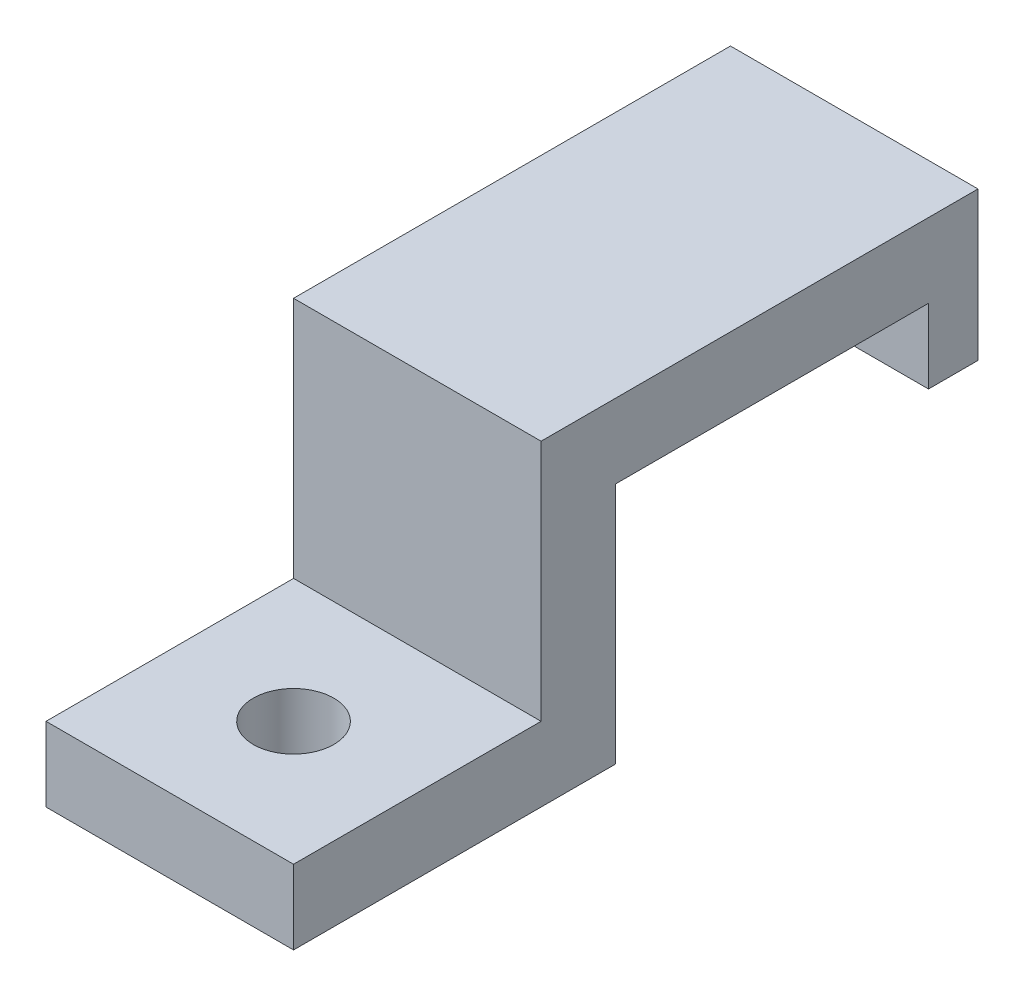
ISO-10303-21;
HEADER;
FILE_DESCRIPTION(('STEP AP214'),'2;1');
FILE_NAME('part.step','',(''),(''),'','','');
FILE_SCHEMA(('AUTOMOTIVE_DESIGN { 1 0 10303 214 1 1 1 1 }'));
ENDSEC;
DATA;
#1=APPLICATION_CONTEXT('core data for automotive mechanical design processes');
#2=APPLICATION_PROTOCOL_DEFINITION('international standard','automotive_design',2000,#1);
#3=PRODUCT_CONTEXT('',#1,'mechanical');
#4=PRODUCT('Part','Part','',(#3));
#5=PRODUCT_RELATED_PRODUCT_CATEGORY('part','',(#4));
#6=PRODUCT_DEFINITION_FORMATION('','',#4);
#7=PRODUCT_DEFINITION_CONTEXT('part definition',#1,'design');
#8=PRODUCT_DEFINITION('design','',#6,#7);
#9=PRODUCT_DEFINITION_SHAPE('','',#8);
#10=(LENGTH_UNIT() NAMED_UNIT(*) SI_UNIT(.MILLI.,.METRE.));
#11=(NAMED_UNIT(*) PLANE_ANGLE_UNIT() SI_UNIT($,.RADIAN.));
#12=(NAMED_UNIT(*) SI_UNIT($,.STERADIAN.) SOLID_ANGLE_UNIT());
#13=UNCERTAINTY_MEASURE_WITH_UNIT(LENGTH_MEASURE(1.E-05),#10,'distance_accuracy_value','');
#14=(GEOMETRIC_REPRESENTATION_CONTEXT(3) GLOBAL_UNCERTAINTY_ASSIGNED_CONTEXT((#13)) GLOBAL_UNIT_ASSIGNED_CONTEXT((#10,
#11,#12)) REPRESENTATION_CONTEXT('',''));
#15=CARTESIAN_POINT('',(0.,0.,0.));
#16=DIRECTION('',(0.,0.,1.));
#17=DIRECTION('',(1.,0.,0.));
#18=AXIS2_PLACEMENT_3D('',#15,#16,#17);
#19=CARTESIAN_POINT('',(10.,3.,0.));
#20=DIRECTION('',(0.,0.,-1.));
#21=DIRECTION('',(0.,1.,0.));
#22=AXIS2_PLACEMENT_3D('',#19,#20,#21);
#23=PLANE('',#22);
#24=DIRECTION('',(0.,-1.,0.));
#25=VECTOR('',#24,1.);
#26=CARTESIAN_POINT('',(0.,3.,0.));
#27=LINE('',#26,#25);
#28=CARTESIAN_POINT('',(0.,3.,0.));
#29=VERTEX_POINT('',#28);
#30=CARTESIAN_POINT('',(0.,0.,0.));
#31=VERTEX_POINT('',#30);
#32=EDGE_CURVE('E129',#29,#31,#27,.T.);
#33=ORIENTED_EDGE('',*,*,#32,.T.);
#34=DIRECTION('',(-1.,0.,0.));
#35=VECTOR('',#34,1.);
#36=CARTESIAN_POINT('',(10.,0.,0.));
#37=LINE('',#36,#35);
#38=CARTESIAN_POINT('',(10.,0.,0.));
#39=VERTEX_POINT('',#38);
#40=EDGE_CURVE('E11',#39,#31,#37,.T.);
#41=ORIENTED_EDGE('',*,*,#40,.F.);
#42=DIRECTION('',(0.,-1.,0.));
#43=VECTOR('',#42,1.);
#44=CARTESIAN_POINT('',(10.,3.,0.));
#45=LINE('',#44,#43);
#46=CARTESIAN_POINT('',(10.,3.,0.));
#47=VERTEX_POINT('',#46);
#48=EDGE_CURVE('E141',#47,#39,#45,.T.);
#49=ORIENTED_EDGE('',*,*,#48,.F.);
#50=DIRECTION('',(-1.,0.,0.));
#51=VECTOR('',#50,1.);
#52=CARTESIAN_POINT('',(10.,3.,0.));
#53=LINE('',#52,#51);
#54=EDGE_CURVE('E125',#47,#29,#53,.T.);
#55=ORIENTED_EDGE('',*,*,#54,.T.);
#56=EDGE_LOOP('',(#33,#41,#49,#55));
#57=FACE_BOUND('',#56,.T.);
#58=ADVANCED_FACE('F33',(#57),#23,.F.);
#59=CARTESIAN_POINT('',(10.,0.,0.));
#60=DIRECTION('',(0.,1.,0.));
#61=DIRECTION('',(0.,0.,1.));
#62=AXIS2_PLACEMENT_3D('',#59,#60,#61);
#63=PLANE('',#62);
#64=CARTESIAN_POINT('',(5.,0.,-5.));
#65=DIRECTION('',(0.,1.,0.));
#66=DIRECTION('',(0.,0.,1.));
#67=AXIS2_PLACEMENT_3D('',#64,#65,#66);
#68=CIRCLE('',#67,1.625);
#69=CARTESIAN_POINT('',(5.,0.,-3.375));
#70=VERTEX_POINT('',#69);
#71=EDGE_CURVE('E219',#70,#70,#68,.T.);
#72=ORIENTED_EDGE('',*,*,#71,.T.);
#73=EDGE_LOOP('',(#72));
#74=FACE_BOUND('',#73,.T.);
#75=DIRECTION('',(0.,0.,-1.));
#76=VECTOR('',#75,1.);
#77=CARTESIAN_POINT('',(0.,0.,0.));
#78=LINE('',#77,#76);
#79=CARTESIAN_POINT('',(0.,0.,-13.));
#80=VERTEX_POINT('',#79);
#81=EDGE_CURVE('E132',#31,#80,#78,.T.);
#82=ORIENTED_EDGE('',*,*,#81,.T.);
#83=DIRECTION('',(-1.,0.,0.));
#84=VECTOR('',#83,1.);
#85=CARTESIAN_POINT('',(10.,0.,-13.));
#86=LINE('',#85,#84);
#87=CARTESIAN_POINT('',(10.,0.,-13.));
#88=VERTEX_POINT('',#87);
#89=EDGE_CURVE('E42',#88,#80,#86,.T.);
#90=ORIENTED_EDGE('',*,*,#89,.F.);
#91=DIRECTION('',(0.,0.,-1.));
#92=VECTOR('',#91,1.);
#93=CARTESIAN_POINT('',(10.,0.,0.));
#94=LINE('',#93,#92);
#95=EDGE_CURVE('E89',#39,#88,#94,.T.);
#96=ORIENTED_EDGE('',*,*,#95,.F.);
#97=ORIENTED_EDGE('',*,*,#40,.T.);
#98=EDGE_LOOP('',(#82,#90,#96,#97));
#99=FACE_BOUND('',#98,.T.);
#100=ADVANCED_FACE('F239',(#74,#99),#63,.F.);
#101=CARTESIAN_POINT('',(10.,0.,-13.));
#102=DIRECTION('',(0.,0.,1.));
#103=DIRECTION('',(1.,0.,0.));
#104=AXIS2_PLACEMENT_3D('',#101,#102,#103);
#105=PLANE('',#104);
#106=DIRECTION('',(0.,1.,0.));
#107=VECTOR('',#106,1.);
#108=CARTESIAN_POINT('',(0.,0.,-13.));
#109=LINE('',#108,#107);
#110=CARTESIAN_POINT('',(0.,9.8,-13.));
#111=VERTEX_POINT('',#110);
#112=EDGE_CURVE('E135',#80,#111,#109,.T.);
#113=ORIENTED_EDGE('',*,*,#112,.T.);
#114=DIRECTION('',(-1.,0.,0.));
#115=VECTOR('',#114,1.);
#116=CARTESIAN_POINT('',(10.,9.8,-13.));
#117=LINE('',#116,#115);
#118=CARTESIAN_POINT('',(10.,9.8,-13.));
#119=VERTEX_POINT('',#118);
#120=EDGE_CURVE('E146',#119,#111,#117,.T.);
#121=ORIENTED_EDGE('',*,*,#120,.F.);
#122=DIRECTION('',(0.,1.,0.));
#123=VECTOR('',#122,1.);
#124=CARTESIAN_POINT('',(10.,0.,-13.));
#125=LINE('',#124,#123);
#126=EDGE_CURVE('E154',#88,#119,#125,.T.);
#127=ORIENTED_EDGE('',*,*,#126,.F.);
#128=ORIENTED_EDGE('',*,*,#89,.T.);
#129=EDGE_LOOP('',(#113,#121,#127,#128));
#130=FACE_BOUND('',#129,.T.);
#131=ADVANCED_FACE('F244',(#130),#105,.F.);
#132=CARTESIAN_POINT('',(10.,9.8,-13.));
#133=DIRECTION('',(0.,1.,0.));
#134=DIRECTION('',(0.,0.,1.));
#135=AXIS2_PLACEMENT_3D('',#132,#133,#134);
#136=PLANE('',#135);
#137=DIRECTION('',(0.,0.,-1.));
#138=VECTOR('',#137,1.);
#139=CARTESIAN_POINT('',(0.,9.8,-13.));
#140=LINE('',#139,#138);
#141=CARTESIAN_POINT('',(0.,9.8,-25.65));
#142=VERTEX_POINT('',#141);
#143=EDGE_CURVE('E137',#111,#142,#140,.T.);
#144=ORIENTED_EDGE('',*,*,#143,.T.);
#145=DIRECTION('',(-1.,0.,0.));
#146=VECTOR('',#145,1.);
#147=CARTESIAN_POINT('',(10.,9.8,-25.65));
#148=LINE('',#147,#146);
#149=CARTESIAN_POINT('',(10.,9.8,-25.65));
#150=VERTEX_POINT('',#149);
#151=EDGE_CURVE('E120',#150,#142,#148,.T.);
#152=ORIENTED_EDGE('',*,*,#151,.F.);
#153=DIRECTION('',(0.,0.,-1.));
#154=VECTOR('',#153,1.);
#155=CARTESIAN_POINT('',(10.,9.8,-13.));
#156=LINE('',#155,#154);
#157=EDGE_CURVE('E114',#119,#150,#156,.T.);
#158=ORIENTED_EDGE('',*,*,#157,.F.);
#159=ORIENTED_EDGE('',*,*,#120,.T.);
#160=EDGE_LOOP('',(#144,#152,#158,#159));
#161=FACE_BOUND('',#160,.T.);
#162=ADVANCED_FACE('F213',(#161),#136,.F.);
#163=CARTESIAN_POINT('',(10.,12.8,-25.65));
#164=DIRECTION('',(0.,-1.,0.));
#165=DIRECTION('',(0.,0.,-1.));
#166=AXIS2_PLACEMENT_3D('',#163,#164,#165);
#167=PLANE('',#166);
#168=DIRECTION('',(0.,0.,1.));
#169=VECTOR('',#168,1.);
#170=CARTESIAN_POINT('',(0.,12.8,-25.65));
#171=LINE('',#170,#169);
#172=CARTESIAN_POINT('',(0.,12.8,-27.65));
#173=VERTEX_POINT('',#172);
#174=CARTESIAN_POINT('',(0.,12.8,-10.));
#175=VERTEX_POINT('',#174);
#176=EDGE_CURVE('E119',#173,#175,#171,.T.);
#177=ORIENTED_EDGE('',*,*,#176,.T.);
#178=DIRECTION('',(-1.,0.,0.));
#179=VECTOR('',#178,1.);
#180=CARTESIAN_POINT('',(10.,12.8,-10.));
#181=LINE('',#180,#179);
#182=CARTESIAN_POINT('',(10.,12.8,-10.));
#183=VERTEX_POINT('',#182);
#184=EDGE_CURVE('E116',#183,#175,#181,.T.);
#185=ORIENTED_EDGE('',*,*,#184,.F.);
#186=DIRECTION('',(0.,0.,1.));
#187=VECTOR('',#186,1.);
#188=CARTESIAN_POINT('',(10.,12.8,-25.65));
#189=LINE('',#188,#187);
#190=CARTESIAN_POINT('',(10.,12.8,-27.65));
#191=VERTEX_POINT('',#190);
#192=EDGE_CURVE('E102',#191,#183,#189,.T.);
#193=ORIENTED_EDGE('',*,*,#192,.F.);
#194=DIRECTION('',(-1.,0.,0.));
#195=VECTOR('',#194,1.);
#196=CARTESIAN_POINT('',(10.,12.8,-27.65));
#197=LINE('',#196,#195);
#198=EDGE_CURVE('E177',#191,#173,#197,.T.);
#199=ORIENTED_EDGE('',*,*,#198,.T.);
#200=EDGE_LOOP('',(#177,#185,#193,#199));
#201=FACE_BOUND('',#200,.T.);
#202=ADVANCED_FACE('F117',(#201),#167,.F.);
#203=CARTESIAN_POINT('',(10.,12.8,-10.));
#204=DIRECTION('',(0.,0.,-1.));
#205=DIRECTION('',(0.,1.,0.));
#206=AXIS2_PLACEMENT_3D('',#203,#204,#205);
#207=PLANE('',#206);
#208=DIRECTION('',(0.,-1.,0.));
#209=VECTOR('',#208,1.);
#210=CARTESIAN_POINT('',(0.,12.8,-10.));
#211=LINE('',#210,#209);
#212=CARTESIAN_POINT('',(0.,3.,-10.));
#213=VERTEX_POINT('',#212);
#214=EDGE_CURVE('E75',#175,#213,#211,.T.);
#215=ORIENTED_EDGE('',*,*,#214,.T.);
#216=DIRECTION('',(-1.,0.,0.));
#217=VECTOR('',#216,1.);
#218=CARTESIAN_POINT('',(10.,3.,-10.));
#219=LINE('',#218,#217);
#220=CARTESIAN_POINT('',(10.,3.,-10.));
#221=VERTEX_POINT('',#220);
#222=EDGE_CURVE('E121',#221,#213,#219,.T.);
#223=ORIENTED_EDGE('',*,*,#222,.F.);
#224=DIRECTION('',(0.,-1.,0.));
#225=VECTOR('',#224,1.);
#226=CARTESIAN_POINT('',(10.,12.8,-10.));
#227=LINE('',#226,#225);
#228=EDGE_CURVE('E106',#183,#221,#227,.T.);
#229=ORIENTED_EDGE('',*,*,#228,.F.);
#230=ORIENTED_EDGE('',*,*,#184,.T.);
#231=EDGE_LOOP('',(#215,#223,#229,#230));
#232=FACE_BOUND('',#231,.T.);
#233=ADVANCED_FACE('F123',(#232),#207,.F.);
#234=CARTESIAN_POINT('',(10.,3.,-10.));
#235=DIRECTION('',(0.,-1.,0.));
#236=DIRECTION('',(0.,0.,-1.));
#237=AXIS2_PLACEMENT_3D('',#234,#235,#236);
#238=PLANE('',#237);
#239=CARTESIAN_POINT('',(5.,3.,-5.));
#240=DIRECTION('',(0.,1.,0.));
#241=DIRECTION('',(0.,0.,1.));
#242=AXIS2_PLACEMENT_3D('',#239,#240,#241);
#243=CIRCLE('',#242,1.625);
#244=CARTESIAN_POINT('',(5.,3.,-3.375));
#245=VERTEX_POINT('',#244);
#246=EDGE_CURVE('E174',#245,#245,#243,.T.);
#247=ORIENTED_EDGE('',*,*,#246,.F.);
#248=EDGE_LOOP('',(#247));
#249=FACE_BOUND('',#248,.T.);
#250=DIRECTION('',(0.,0.,1.));
#251=VECTOR('',#250,1.);
#252=CARTESIAN_POINT('',(0.,3.,-10.));
#253=LINE('',#252,#251);
#254=EDGE_CURVE('E81',#213,#29,#253,.T.);
#255=ORIENTED_EDGE('',*,*,#254,.T.);
#256=ORIENTED_EDGE('',*,*,#54,.F.);
#257=DIRECTION('',(0.,0.,1.));
#258=VECTOR('',#257,1.);
#259=CARTESIAN_POINT('',(10.,3.,-10.));
#260=LINE('',#259,#258);
#261=EDGE_CURVE('E51',#221,#47,#260,.T.);
#262=ORIENTED_EDGE('',*,*,#261,.F.);
#263=ORIENTED_EDGE('',*,*,#222,.T.);
#264=EDGE_LOOP('',(#255,#256,#262,#263));
#265=FACE_BOUND('',#264,.T.);
#266=ADVANCED_FACE('F228',(#249,#265),#238,.F.);
#267=CARTESIAN_POINT('',(10.,0.,0.));
#268=DIRECTION('',(1.,0.,0.));
#269=DIRECTION('',(0.,0.,-1.));
#270=AXIS2_PLACEMENT_3D('',#267,#268,#269);
#271=PLANE('',#270);
#272=ORIENTED_EDGE('',*,*,#48,.T.);
#273=ORIENTED_EDGE('',*,*,#95,.T.);
#274=ORIENTED_EDGE('',*,*,#126,.T.);
#275=ORIENTED_EDGE('',*,*,#157,.T.);
#276=DIRECTION('',(0.,-1.,0.));
#277=VECTOR('',#276,1.);
#278=CARTESIAN_POINT('',(10.,12.8,-25.65));
#279=LINE('',#278,#277);
#280=CARTESIAN_POINT('',(10.,6.8,-25.65));
#281=VERTEX_POINT('',#280);
#282=EDGE_CURVE('E163',#150,#281,#279,.T.);
#283=ORIENTED_EDGE('',*,*,#282,.T.);
#284=DIRECTION('',(0.,0.,-1.));
#285=VECTOR('',#284,1.);
#286=CARTESIAN_POINT('',(10.,6.8,-25.65));
#287=LINE('',#286,#285);
#288=CARTESIAN_POINT('',(10.,6.8,-27.65));
#289=VERTEX_POINT('',#288);
#290=EDGE_CURVE('E166',#281,#289,#287,.T.);
#291=ORIENTED_EDGE('',*,*,#290,.T.);
#292=DIRECTION('',(0.,1.,0.));
#293=VECTOR('',#292,1.);
#294=CARTESIAN_POINT('',(10.,12.8,-27.65));
#295=LINE('',#294,#293);
#296=EDGE_CURVE('E110',#289,#191,#295,.T.);
#297=ORIENTED_EDGE('',*,*,#296,.T.);
#298=ORIENTED_EDGE('',*,*,#192,.T.);
#299=ORIENTED_EDGE('',*,*,#228,.T.);
#300=ORIENTED_EDGE('',*,*,#261,.T.);
#301=EDGE_LOOP('',(#272,#273,#274,#275,#283,#291,#297,#298,#299,#300));
#302=FACE_BOUND('',#301,.T.);
#303=ADVANCED_FACE('F104',(#302),#271,.T.);
#304=CARTESIAN_POINT('',(0.,0.,0.));
#305=DIRECTION('',(1.,0.,0.));
#306=DIRECTION('',(0.,0.,-1.));
#307=AXIS2_PLACEMENT_3D('',#304,#305,#306);
#308=PLANE('',#307);
#309=ORIENTED_EDGE('',*,*,#32,.F.);
#310=ORIENTED_EDGE('',*,*,#254,.F.);
#311=ORIENTED_EDGE('',*,*,#214,.F.);
#312=ORIENTED_EDGE('',*,*,#176,.F.);
#313=DIRECTION('',(0.,1.,0.));
#314=VECTOR('',#313,1.);
#315=CARTESIAN_POINT('',(0.,12.8,-27.65));
#316=LINE('',#315,#314);
#317=CARTESIAN_POINT('',(0.,6.8,-27.65));
#318=VERTEX_POINT('',#317);
#319=EDGE_CURVE('E167',#318,#173,#316,.T.);
#320=ORIENTED_EDGE('',*,*,#319,.F.);
#321=DIRECTION('',(0.,0.,-1.));
#322=VECTOR('',#321,1.);
#323=CARTESIAN_POINT('',(0.,6.8,-25.65));
#324=LINE('',#323,#322);
#325=CARTESIAN_POINT('',(0.,6.8,-25.65));
#326=VERTEX_POINT('',#325);
#327=EDGE_CURVE('E180',#326,#318,#324,.T.);
#328=ORIENTED_EDGE('',*,*,#327,.F.);
#329=DIRECTION('',(0.,-1.,0.));
#330=VECTOR('',#329,1.);
#331=CARTESIAN_POINT('',(0.,12.8,-25.65));
#332=LINE('',#331,#330);
#333=EDGE_CURVE('E168',#142,#326,#332,.T.);
#334=ORIENTED_EDGE('',*,*,#333,.F.);
#335=ORIENTED_EDGE('',*,*,#143,.F.);
#336=ORIENTED_EDGE('',*,*,#112,.F.);
#337=ORIENTED_EDGE('',*,*,#81,.F.);
#338=EDGE_LOOP('',(#309,#310,#311,#312,#320,#328,#334,#335,#336,#337));
#339=FACE_BOUND('',#338,.T.);
#340=ADVANCED_FACE('F217',(#339),#308,.F.);
#341=CARTESIAN_POINT('',(10.,12.8,-25.65));
#342=DIRECTION('',(0.,0.,-1.));
#343=DIRECTION('',(-1.,0.,0.));
#344=AXIS2_PLACEMENT_3D('',#341,#342,#343);
#345=PLANE('',#344);
#346=ORIENTED_EDGE('',*,*,#282,.F.);
#347=ORIENTED_EDGE('',*,*,#151,.T.);
#348=ORIENTED_EDGE('',*,*,#333,.T.);
#349=DIRECTION('',(-1.,0.,0.));
#350=VECTOR('',#349,1.);
#351=CARTESIAN_POINT('',(10.,6.8,-25.65));
#352=LINE('',#351,#350);
#353=EDGE_CURVE('E133',#281,#326,#352,.T.);
#354=ORIENTED_EDGE('',*,*,#353,.F.);
#355=EDGE_LOOP('',(#346,#347,#348,#354));
#356=FACE_BOUND('',#355,.T.);
#357=ADVANCED_FACE('F202',(#356),#345,.F.);
#358=CARTESIAN_POINT('',(10.,6.8,-25.65));
#359=DIRECTION('',(0.,1.,0.));
#360=DIRECTION('',(0.,0.,1.));
#361=AXIS2_PLACEMENT_3D('',#358,#359,#360);
#362=PLANE('',#361);
#363=ORIENTED_EDGE('',*,*,#327,.T.);
#364=DIRECTION('',(-1.,0.,0.));
#365=VECTOR('',#364,1.);
#366=CARTESIAN_POINT('',(10.,6.8,-27.65));
#367=LINE('',#366,#365);
#368=EDGE_CURVE('E186',#289,#318,#367,.T.);
#369=ORIENTED_EDGE('',*,*,#368,.F.);
#370=ORIENTED_EDGE('',*,*,#290,.F.);
#371=ORIENTED_EDGE('',*,*,#353,.T.);
#372=EDGE_LOOP('',(#363,#369,#370,#371));
#373=FACE_BOUND('',#372,.T.);
#374=ADVANCED_FACE('F193',(#373),#362,.F.);
#375=CARTESIAN_POINT('',(10.,12.8,-27.65));
#376=DIRECTION('',(0.,0.,1.));
#377=DIRECTION('',(1.,0.,0.));
#378=AXIS2_PLACEMENT_3D('',#375,#376,#377);
#379=PLANE('',#378);
#380=ORIENTED_EDGE('',*,*,#319,.T.);
#381=ORIENTED_EDGE('',*,*,#198,.F.);
#382=ORIENTED_EDGE('',*,*,#296,.F.);
#383=ORIENTED_EDGE('',*,*,#368,.T.);
#384=EDGE_LOOP('',(#380,#381,#382,#383));
#385=FACE_BOUND('',#384,.T.);
#386=ADVANCED_FACE('F314',(#385),#379,.F.);
#387=CARTESIAN_POINT('',(5.,0.,-5.));
#388=DIRECTION('',(0.,1.,0.));
#389=DIRECTION('',(0.,0.,1.));
#390=AXIS2_PLACEMENT_3D('',#387,#388,#389);
#391=CYLINDRICAL_SURFACE('',#390,1.625);
#392=ORIENTED_EDGE('',*,*,#71,.F.);
#393=EDGE_LOOP('',(#392));
#394=FACE_BOUND('',#393,.T.);
#395=ORIENTED_EDGE('',*,*,#246,.T.);
#396=EDGE_LOOP('',(#395));
#397=FACE_BOUND('',#396,.T.);
#398=ADVANCED_FACE('F226',(#394,#397),#391,.F.);
#399=CLOSED_SHELL('',(#58,#100,#131,#162,#202,#233,#266,#303,#340,#357,#374,#386,#398));
#400=MANIFOLD_SOLID_BREP('B2',#399);
#401=ADVANCED_BREP_SHAPE_REPRESENTATION('',(#18,#400),#14);
#402=SHAPE_DEFINITION_REPRESENTATION(#9,#401);
ENDSEC;
END-ISO-10303-21;
